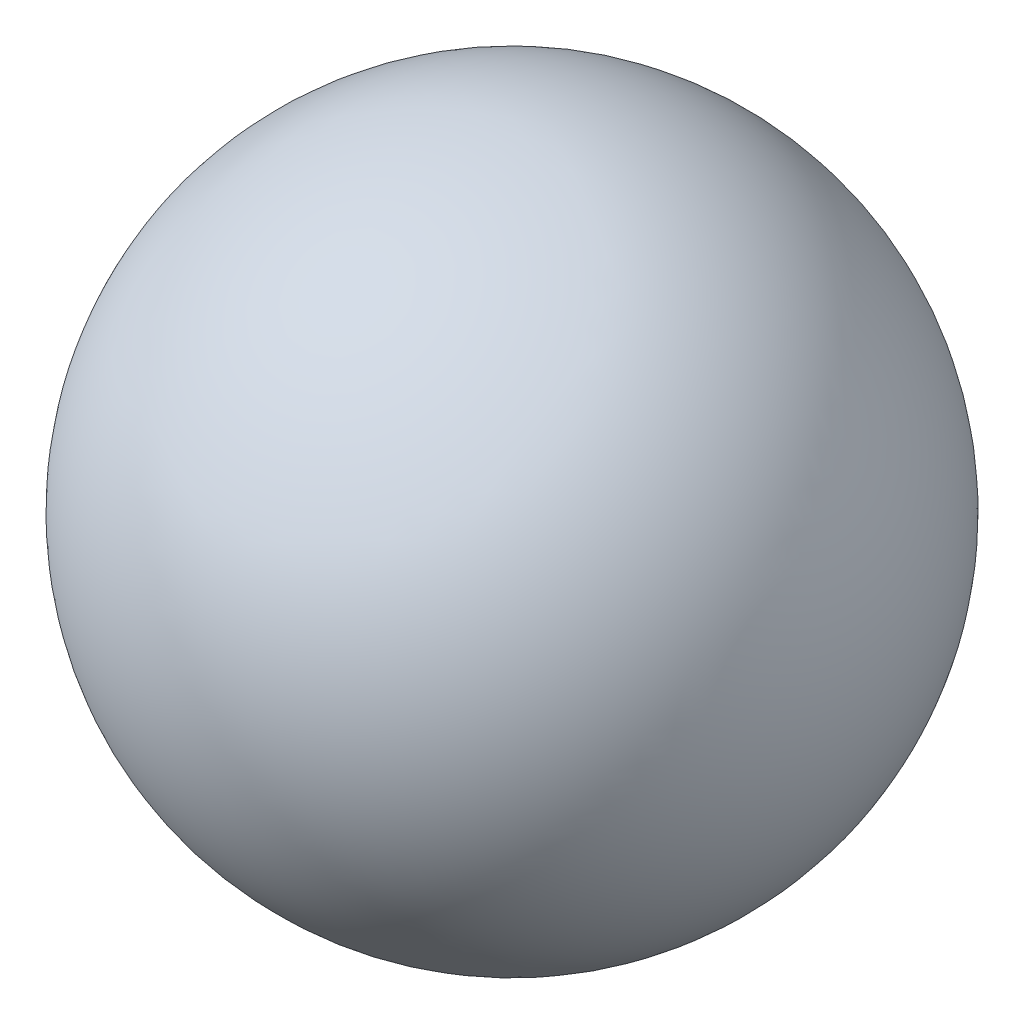
ISO-10303-21;
HEADER;
FILE_DESCRIPTION(('STEP AP214'),'2;1');
FILE_NAME('part.step','',(''),(''),'','','');
FILE_SCHEMA(('AUTOMOTIVE_DESIGN { 1 0 10303 214 1 1 1 1 }'));
ENDSEC;
DATA;
#1=APPLICATION_CONTEXT('core data for automotive mechanical design processes');
#2=APPLICATION_PROTOCOL_DEFINITION('international standard','automotive_design',2000,#1);
#3=PRODUCT_CONTEXT('',#1,'mechanical');
#4=PRODUCT('Part','Part','',(#3));
#5=PRODUCT_RELATED_PRODUCT_CATEGORY('part','',(#4));
#6=PRODUCT_DEFINITION_FORMATION('','',#4);
#7=PRODUCT_DEFINITION_CONTEXT('part definition',#1,'design');
#8=PRODUCT_DEFINITION('design','',#6,#7);
#9=PRODUCT_DEFINITION_SHAPE('','',#8);
#10=(LENGTH_UNIT() NAMED_UNIT(*) SI_UNIT(.MILLI.,.METRE.));
#11=(NAMED_UNIT(*) PLANE_ANGLE_UNIT() SI_UNIT($,.RADIAN.));
#12=(NAMED_UNIT(*) SI_UNIT($,.STERADIAN.) SOLID_ANGLE_UNIT());
#13=UNCERTAINTY_MEASURE_WITH_UNIT(LENGTH_MEASURE(1.E-05),#10,'distance_accuracy_value','');
#14=(GEOMETRIC_REPRESENTATION_CONTEXT(3) GLOBAL_UNCERTAINTY_ASSIGNED_CONTEXT((#13)) GLOBAL_UNIT_ASSIGNED_CONTEXT((#10,
#11,#12)) REPRESENTATION_CONTEXT('',''));
#15=CARTESIAN_POINT('',(0.,0.,0.));
#16=DIRECTION('',(0.,0.,1.));
#17=DIRECTION('',(1.,0.,0.));
#18=AXIS2_PLACEMENT_3D('',#15,#16,#17);
#19=CARTESIAN_POINT('',(0.,0.,0.));
#20=DIRECTION('',(-1.,0.,0.));
#21=DIRECTION('',(0.,0.,-1.));
#22=AXIS2_PLACEMENT_3D('',#19,#20,#21);
#23=SPHERICAL_SURFACE('',#22,12.5);
#24=CARTESIAN_POINT('',(-12.5,0.,0.));
#25=VERTEX_POINT('',#24);
#26=VERTEX_LOOP('',#25);
#27=FACE_BOUND('',#26,.T.);
#28=ADVANCED_FACE('F33',(#27),#23,.T.);
#29=CLOSED_SHELL('',(#28));
#30=MANIFOLD_SOLID_BREP('B2',#29);
#31=ADVANCED_BREP_SHAPE_REPRESENTATION('',(#18,#30),#14);
#32=SHAPE_DEFINITION_REPRESENTATION(#9,#31);
ENDSEC;
END-ISO-10303-21;
